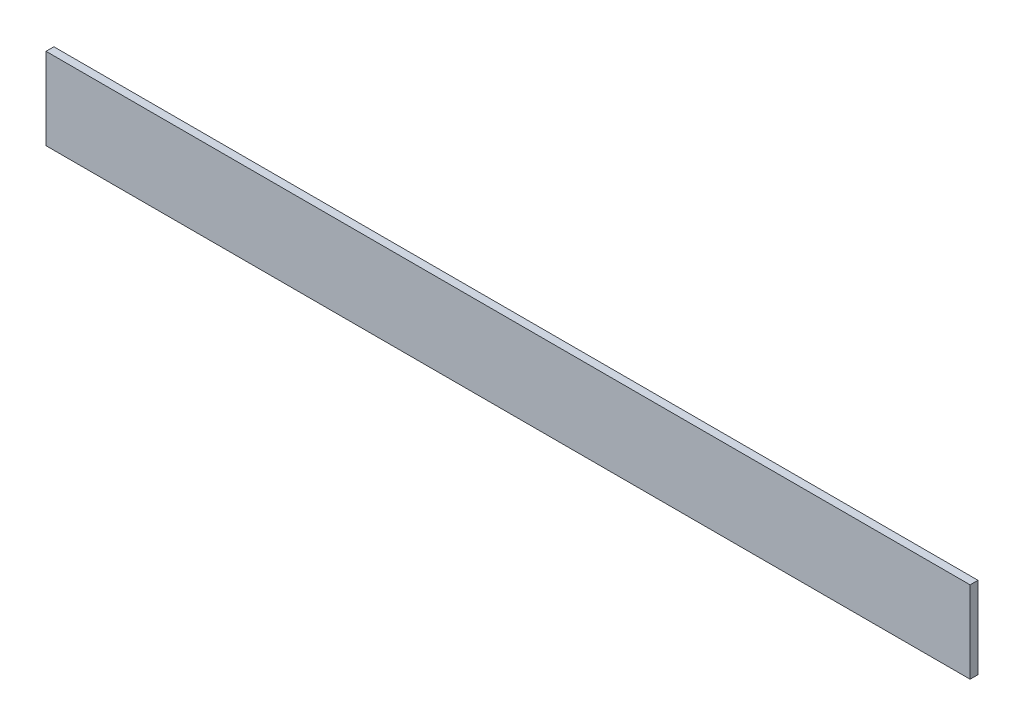
ISO-10303-21;
HEADER;
FILE_DESCRIPTION(('STEP AP214'),'2;1');
FILE_NAME('part.step','',(''),(''),'','','');
FILE_SCHEMA(('AUTOMOTIVE_DESIGN { 1 0 10303 214 1 1 1 1 }'));
ENDSEC;
DATA;
#1=APPLICATION_CONTEXT('core data for automotive mechanical design processes');
#2=APPLICATION_PROTOCOL_DEFINITION('international standard','automotive_design',2000,#1);
#3=PRODUCT_CONTEXT('',#1,'mechanical');
#4=PRODUCT('Part','Part','',(#3));
#5=PRODUCT_RELATED_PRODUCT_CATEGORY('part','',(#4));
#6=PRODUCT_DEFINITION_FORMATION('','',#4);
#7=PRODUCT_DEFINITION_CONTEXT('part definition',#1,'design');
#8=PRODUCT_DEFINITION('design','',#6,#7);
#9=PRODUCT_DEFINITION_SHAPE('','',#8);
#10=(LENGTH_UNIT() NAMED_UNIT(*) SI_UNIT(.MILLI.,.METRE.));
#11=(NAMED_UNIT(*) PLANE_ANGLE_UNIT() SI_UNIT($,.RADIAN.));
#12=(NAMED_UNIT(*) SI_UNIT($,.STERADIAN.) SOLID_ANGLE_UNIT());
#13=UNCERTAINTY_MEASURE_WITH_UNIT(LENGTH_MEASURE(1.E-05),#10,'distance_accuracy_value','');
#14=(GEOMETRIC_REPRESENTATION_CONTEXT(3) GLOBAL_UNCERTAINTY_ASSIGNED_CONTEXT((#13)) GLOBAL_UNIT_ASSIGNED_CONTEXT((#10,
#11,#12)) REPRESENTATION_CONTEXT('',''));
#15=CARTESIAN_POINT('',(0.,0.,0.));
#16=DIRECTION('',(0.,0.,1.));
#17=DIRECTION('',(1.,0.,0.));
#18=AXIS2_PLACEMENT_3D('',#15,#16,#17);
#19=CARTESIAN_POINT('',(0.,0.,-8.));
#20=DIRECTION('',(-1.,0.,0.));
#21=DIRECTION('',(0.,0.,1.));
#22=AXIS2_PLACEMENT_3D('',#19,#20,#21);
#23=PLANE('',#22);
#24=DIRECTION('',(0.,-1.,0.));
#25=VECTOR('',#24,1.);
#26=CARTESIAN_POINT('',(0.,0.,0.));
#27=LINE('',#26,#25);
#28=CARTESIAN_POINT('',(0.,83.,0.));
#29=VERTEX_POINT('',#28);
#30=CARTESIAN_POINT('',(0.,0.,0.));
#31=VERTEX_POINT('',#30);
#32=EDGE_CURVE('E73',#29,#31,#27,.T.);
#33=ORIENTED_EDGE('',*,*,#32,.F.);
#34=DIRECTION('',(0.,0.,1.));
#35=VECTOR('',#34,1.);
#36=CARTESIAN_POINT('',(0.,83.,-8.));
#37=LINE('',#36,#35);
#38=CARTESIAN_POINT('',(0.,83.,-8.));
#39=VERTEX_POINT('',#38);
#40=EDGE_CURVE('E11',#39,#29,#37,.T.);
#41=ORIENTED_EDGE('',*,*,#40,.F.);
#42=DIRECTION('',(0.,-1.,0.));
#43=VECTOR('',#42,1.);
#44=CARTESIAN_POINT('',(0.,0.,-8.));
#45=LINE('',#44,#43);
#46=CARTESIAN_POINT('',(0.,0.,-8.));
#47=VERTEX_POINT('',#46);
#48=EDGE_CURVE('E75',#39,#47,#45,.T.);
#49=ORIENTED_EDGE('',*,*,#48,.T.);
#50=DIRECTION('',(0.,0.,1.));
#51=VECTOR('',#50,1.);
#52=CARTESIAN_POINT('',(0.,0.,-8.));
#53=LINE('',#52,#51);
#54=EDGE_CURVE('E36',#47,#31,#53,.T.);
#55=ORIENTED_EDGE('',*,*,#54,.T.);
#56=EDGE_LOOP('',(#33,#41,#49,#55));
#57=FACE_BOUND('',#56,.T.);
#58=ADVANCED_FACE('F33',(#57),#23,.T.);
#59=CARTESIAN_POINT('',(0.,83.,-8.));
#60=DIRECTION('',(0.,1.,0.));
#61=DIRECTION('',(0.,0.,1.));
#62=AXIS2_PLACEMENT_3D('',#59,#60,#61);
#63=PLANE('',#62);
#64=DIRECTION('',(-1.,0.,0.));
#65=VECTOR('',#64,1.);
#66=CARTESIAN_POINT('',(0.,83.,0.));
#67=LINE('',#66,#65);
#68=CARTESIAN_POINT('',(938.,83.,0.));
#69=VERTEX_POINT('',#68);
#70=EDGE_CURVE('E90',#69,#29,#67,.T.);
#71=ORIENTED_EDGE('',*,*,#70,.F.);
#72=DIRECTION('',(0.,0.,1.));
#73=VECTOR('',#72,1.);
#74=CARTESIAN_POINT('',(938.,83.,-8.));
#75=LINE('',#74,#73);
#76=CARTESIAN_POINT('',(938.,83.,-8.));
#77=VERTEX_POINT('',#76);
#78=EDGE_CURVE('E41',#77,#69,#75,.T.);
#79=ORIENTED_EDGE('',*,*,#78,.F.);
#80=DIRECTION('',(-1.,0.,0.));
#81=VECTOR('',#80,1.);
#82=CARTESIAN_POINT('',(0.,83.,-8.));
#83=LINE('',#82,#81);
#84=EDGE_CURVE('E80',#77,#39,#83,.T.);
#85=ORIENTED_EDGE('',*,*,#84,.T.);
#86=ORIENTED_EDGE('',*,*,#40,.T.);
#87=EDGE_LOOP('',(#71,#79,#85,#86));
#88=FACE_BOUND('',#87,.T.);
#89=ADVANCED_FACE('F105',(#88),#63,.T.);
#90=CARTESIAN_POINT('',(938.,0.,-8.));
#91=DIRECTION('',(1.,0.,0.));
#92=DIRECTION('',(0.,0.,-1.));
#93=AXIS2_PLACEMENT_3D('',#90,#91,#92);
#94=PLANE('',#93);
#95=DIRECTION('',(0.,1.,0.));
#96=VECTOR('',#95,1.);
#97=CARTESIAN_POINT('',(938.,0.,0.));
#98=LINE('',#97,#96);
#99=CARTESIAN_POINT('',(938.,0.,0.));
#100=VERTEX_POINT('',#99);
#101=EDGE_CURVE('E87',#100,#69,#98,.T.);
#102=ORIENTED_EDGE('',*,*,#101,.F.);
#103=DIRECTION('',(0.,0.,1.));
#104=VECTOR('',#103,1.);
#105=CARTESIAN_POINT('',(938.,0.,-8.));
#106=LINE('',#105,#104);
#107=CARTESIAN_POINT('',(938.,0.,-8.));
#108=VERTEX_POINT('',#107);
#109=EDGE_CURVE('E79',#108,#100,#106,.T.);
#110=ORIENTED_EDGE('',*,*,#109,.F.);
#111=DIRECTION('',(0.,1.,0.));
#112=VECTOR('',#111,1.);
#113=CARTESIAN_POINT('',(938.,0.,-8.));
#114=LINE('',#113,#112);
#115=EDGE_CURVE('E98',#108,#77,#114,.T.);
#116=ORIENTED_EDGE('',*,*,#115,.T.);
#117=ORIENTED_EDGE('',*,*,#78,.T.);
#118=EDGE_LOOP('',(#102,#110,#116,#117));
#119=FACE_BOUND('',#118,.T.);
#120=ADVANCED_FACE('F102',(#119),#94,.T.);
#121=CARTESIAN_POINT('',(0.,0.,-8.));
#122=DIRECTION('',(0.,-1.,0.));
#123=DIRECTION('',(0.,0.,-1.));
#124=AXIS2_PLACEMENT_3D('',#121,#122,#123);
#125=PLANE('',#124);
#126=DIRECTION('',(1.,0.,0.));
#127=VECTOR('',#126,1.);
#128=CARTESIAN_POINT('',(0.,0.,0.));
#129=LINE('',#128,#127);
#130=EDGE_CURVE('E82',#31,#100,#129,.T.);
#131=ORIENTED_EDGE('',*,*,#130,.F.);
#132=ORIENTED_EDGE('',*,*,#54,.F.);
#133=DIRECTION('',(1.,0.,0.));
#134=VECTOR('',#133,1.);
#135=CARTESIAN_POINT('',(0.,0.,-8.));
#136=LINE('',#135,#134);
#137=EDGE_CURVE('E96',#47,#108,#136,.T.);
#138=ORIENTED_EDGE('',*,*,#137,.T.);
#139=ORIENTED_EDGE('',*,*,#109,.T.);
#140=EDGE_LOOP('',(#131,#132,#138,#139));
#141=FACE_BOUND('',#140,.T.);
#142=ADVANCED_FACE('F83',(#141),#125,.T.);
#143=CARTESIAN_POINT('',(0.,83.,-8.));
#144=DIRECTION('',(0.,0.,-1.));
#145=DIRECTION('',(-1.,0.,0.));
#146=AXIS2_PLACEMENT_3D('',#143,#144,#145);
#147=PLANE('',#146);
#148=ORIENTED_EDGE('',*,*,#48,.F.);
#149=ORIENTED_EDGE('',*,*,#84,.F.);
#150=ORIENTED_EDGE('',*,*,#115,.F.);
#151=ORIENTED_EDGE('',*,*,#137,.F.);
#152=EDGE_LOOP('',(#148,#149,#150,#151));
#153=FACE_BOUND('',#152,.T.);
#154=ADVANCED_FACE('F107',(#153),#147,.T.);
#155=CARTESIAN_POINT('',(0.,83.,0.));
#156=DIRECTION('',(0.,0.,-1.));
#157=DIRECTION('',(-1.,0.,0.));
#158=AXIS2_PLACEMENT_3D('',#155,#156,#157);
#159=PLANE('',#158);
#160=ORIENTED_EDGE('',*,*,#32,.T.);
#161=ORIENTED_EDGE('',*,*,#130,.T.);
#162=ORIENTED_EDGE('',*,*,#101,.T.);
#163=ORIENTED_EDGE('',*,*,#70,.T.);
#164=EDGE_LOOP('',(#160,#161,#162,#163));
#165=FACE_BOUND('',#164,.T.);
#166=ADVANCED_FACE('F89',(#165),#159,.F.);
#167=CLOSED_SHELL('',(#58,#89,#120,#142,#154,#166));
#168=MANIFOLD_SOLID_BREP('B2',#167);
#169=ADVANCED_BREP_SHAPE_REPRESENTATION('',(#18,#168),#14);
#170=SHAPE_DEFINITION_REPRESENTATION(#9,#169);
ENDSEC;
END-ISO-10303-21;
